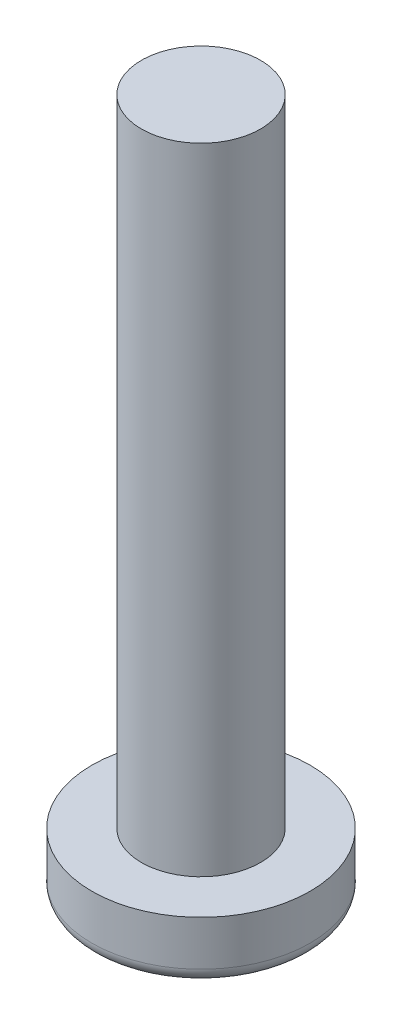
ISO-10303-21;
HEADER;
FILE_DESCRIPTION(('STEP AP214'),'2;1');
FILE_NAME('part.step','',(''),(''),'','','');
FILE_SCHEMA(('AUTOMOTIVE_DESIGN { 1 0 10303 214 1 1 1 1 }'));
ENDSEC;
DATA;
#1=APPLICATION_CONTEXT('core data for automotive mechanical design processes');
#2=APPLICATION_PROTOCOL_DEFINITION('international standard','automotive_design',2000,#1);
#3=PRODUCT_CONTEXT('',#1,'mechanical');
#4=PRODUCT('Part','Part','',(#3));
#5=PRODUCT_RELATED_PRODUCT_CATEGORY('part','',(#4));
#6=PRODUCT_DEFINITION_FORMATION('','',#4);
#7=PRODUCT_DEFINITION_CONTEXT('part definition',#1,'design');
#8=PRODUCT_DEFINITION('design','',#6,#7);
#9=PRODUCT_DEFINITION_SHAPE('','',#8);
#10=(LENGTH_UNIT() NAMED_UNIT(*) SI_UNIT(.MILLI.,.METRE.));
#11=(NAMED_UNIT(*) PLANE_ANGLE_UNIT() SI_UNIT($,.RADIAN.));
#12=(NAMED_UNIT(*) SI_UNIT($,.STERADIAN.) SOLID_ANGLE_UNIT());
#13=UNCERTAINTY_MEASURE_WITH_UNIT(LENGTH_MEASURE(1.E-05),#10,'distance_accuracy_value','');
#14=(GEOMETRIC_REPRESENTATION_CONTEXT(3) GLOBAL_UNCERTAINTY_ASSIGNED_CONTEXT((#13)) GLOBAL_UNIT_ASSIGNED_CONTEXT((#10,
#11,#12)) REPRESENTATION_CONTEXT('',''));
#15=CARTESIAN_POINT('',(0.,0.,0.));
#16=DIRECTION('',(0.,0.,1.));
#17=DIRECTION('',(1.,0.,0.));
#18=AXIS2_PLACEMENT_3D('',#15,#16,#17);
#19=CARTESIAN_POINT('',(0.,1.5,15.));
#20=DIRECTION('',(0.,-1.,0.));
#21=DIRECTION('',(0.,0.,-1.));
#22=AXIS2_PLACEMENT_3D('',#19,#20,#21);
#23=CYLINDRICAL_SURFACE('',#22,2.75);
#24=CARTESIAN_POINT('',(0.,0.367346938775512,15.));
#25=DIRECTION('',(0.,-1.,0.));
#26=DIRECTION('',(0.,0.,-1.));
#27=AXIS2_PLACEMENT_3D('',#24,#25,#26);
#28=CIRCLE('',#27,2.75);
#29=CARTESIAN_POINT('',(0.,0.367346938775512,12.25));
#30=VERTEX_POINT('',#29);
#31=EDGE_CURVE('E10',#30,#30,#28,.F.);
#32=ORIENTED_EDGE('',*,*,#31,.T.);
#33=EDGE_LOOP('',(#32));
#34=FACE_BOUND('',#33,.T.);
#35=CARTESIAN_POINT('',(0.,1.5,15.));
#36=DIRECTION('',(0.,-1.,0.));
#37=DIRECTION('',(0.,0.,-1.));
#38=AXIS2_PLACEMENT_3D('',#35,#36,#37);
#39=CIRCLE('',#38,2.75);
#40=CARTESIAN_POINT('',(0.,1.5,12.25));
#41=VERTEX_POINT('',#40);
#42=EDGE_CURVE('E41',#41,#41,#39,.T.);
#43=ORIENTED_EDGE('',*,*,#42,.T.);
#44=EDGE_LOOP('',(#43));
#45=FACE_BOUND('',#44,.T.);
#46=ADVANCED_FACE('F30',(#34,#45),#23,.T.);
#47=CARTESIAN_POINT('',(2.75,1.5,15.));
#48=DIRECTION('',(0.,1.,0.));
#49=DIRECTION('',(0.,0.,1.));
#50=AXIS2_PLACEMENT_3D('',#47,#48,#49);
#51=PLANE('',#50);
#52=CARTESIAN_POINT('',(0.,1.5,15.));
#53=DIRECTION('',(0.,1.,0.));
#54=DIRECTION('',(0.,0.,1.));
#55=AXIS2_PLACEMENT_3D('',#52,#53,#54);
#56=CIRCLE('',#55,1.5);
#57=CARTESIAN_POINT('',(0.,1.5,16.5));
#58=VERTEX_POINT('',#57);
#59=EDGE_CURVE('E48',#58,#58,#56,.T.);
#60=ORIENTED_EDGE('',*,*,#59,.F.);
#61=EDGE_LOOP('',(#60));
#62=FACE_BOUND('',#61,.T.);
#63=ORIENTED_EDGE('',*,*,#42,.F.);
#64=EDGE_LOOP('',(#63));
#65=FACE_BOUND('',#64,.T.);
#66=ADVANCED_FACE('F63',(#62,#65),#51,.T.);
#67=CARTESIAN_POINT('',(0.,0.,15.));
#68=DIRECTION('',(0.,-1.,0.));
#69=DIRECTION('',(0.,0.,-1.));
#70=AXIS2_PLACEMENT_3D('',#67,#68,#69);
#71=PLANE('',#70);
#72=CARTESIAN_POINT('',(0.,0.,15.));
#73=DIRECTION('',(0.,-1.,0.));
#74=DIRECTION('',(0.,0.,-1.));
#75=AXIS2_PLACEMENT_3D('',#72,#73,#74);
#76=CIRCLE('',#75,2.38265306122449);
#77=CARTESIAN_POINT('',(0.,0.,12.6173469387755));
#78=VERTEX_POINT('',#77);
#79=EDGE_CURVE('E37',#78,#78,#76,.T.);
#80=ORIENTED_EDGE('',*,*,#79,.T.);
#81=EDGE_LOOP('',(#80));
#82=FACE_BOUND('',#81,.T.);
#83=ADVANCED_FACE('F59',(#82),#71,.T.);
#84=CARTESIAN_POINT('',(0.,17.5,15.));
#85=DIRECTION('',(0.,-1.,0.));
#86=DIRECTION('',(0.,0.,-1.));
#87=AXIS2_PLACEMENT_3D('',#84,#85,#86);
#88=CYLINDRICAL_SURFACE('',#87,1.5);
#89=CARTESIAN_POINT('',(0.,17.5,15.));
#90=DIRECTION('',(0.,1.,0.));
#91=DIRECTION('',(0.,0.,1.));
#92=AXIS2_PLACEMENT_3D('',#89,#90,#91);
#93=CIRCLE('',#92,1.5);
#94=CARTESIAN_POINT('',(0.,17.5,16.5));
#95=VERTEX_POINT('',#94);
#96=EDGE_CURVE('E45',#95,#95,#93,.T.);
#97=ORIENTED_EDGE('',*,*,#96,.F.);
#98=EDGE_LOOP('',(#97));
#99=FACE_BOUND('',#98,.T.);
#100=ORIENTED_EDGE('',*,*,#59,.T.);
#101=EDGE_LOOP('',(#100));
#102=FACE_BOUND('',#101,.T.);
#103=ADVANCED_FACE('F56',(#99,#102),#88,.T.);
#104=CARTESIAN_POINT('',(0.,17.5,15.));
#105=DIRECTION('',(0.,1.,0.));
#106=DIRECTION('',(0.,0.,1.));
#107=AXIS2_PLACEMENT_3D('',#104,#105,#106);
#108=PLANE('',#107);
#109=ORIENTED_EDGE('',*,*,#96,.T.);
#110=EDGE_LOOP('',(#109));
#111=FACE_BOUND('',#110,.T.);
#112=ADVANCED_FACE('F54',(#111),#108,.T.);
#113=CARTESIAN_POINT('',(0.,0.367346938775512,15.));
#114=DIRECTION('',(0.,-1.,0.));
#115=DIRECTION('',(0.,0.,-1.));
#116=AXIS2_PLACEMENT_3D('',#113,#114,#115);
#117=TOROIDAL_SURFACE('',#116,2.38265306122449,0.367346938775511);
#118=ORIENTED_EDGE('',*,*,#31,.F.);
#119=EDGE_LOOP('',(#118));
#120=FACE_BOUND('',#119,.T.);
#121=ORIENTED_EDGE('',*,*,#79,.F.);
#122=EDGE_LOOP('',(#121));
#123=FACE_BOUND('',#122,.T.);
#124=ADVANCED_FACE('F32',(#120,#123),#117,.T.);
#125=CLOSED_SHELL('',(#46,#66,#83,#103,#112,#124));
#126=MANIFOLD_SOLID_BREP('B2',#125);
#127=ADVANCED_BREP_SHAPE_REPRESENTATION('',(#18,#126),#14);
#128=SHAPE_DEFINITION_REPRESENTATION(#9,#127);
ENDSEC;
END-ISO-10303-21;
